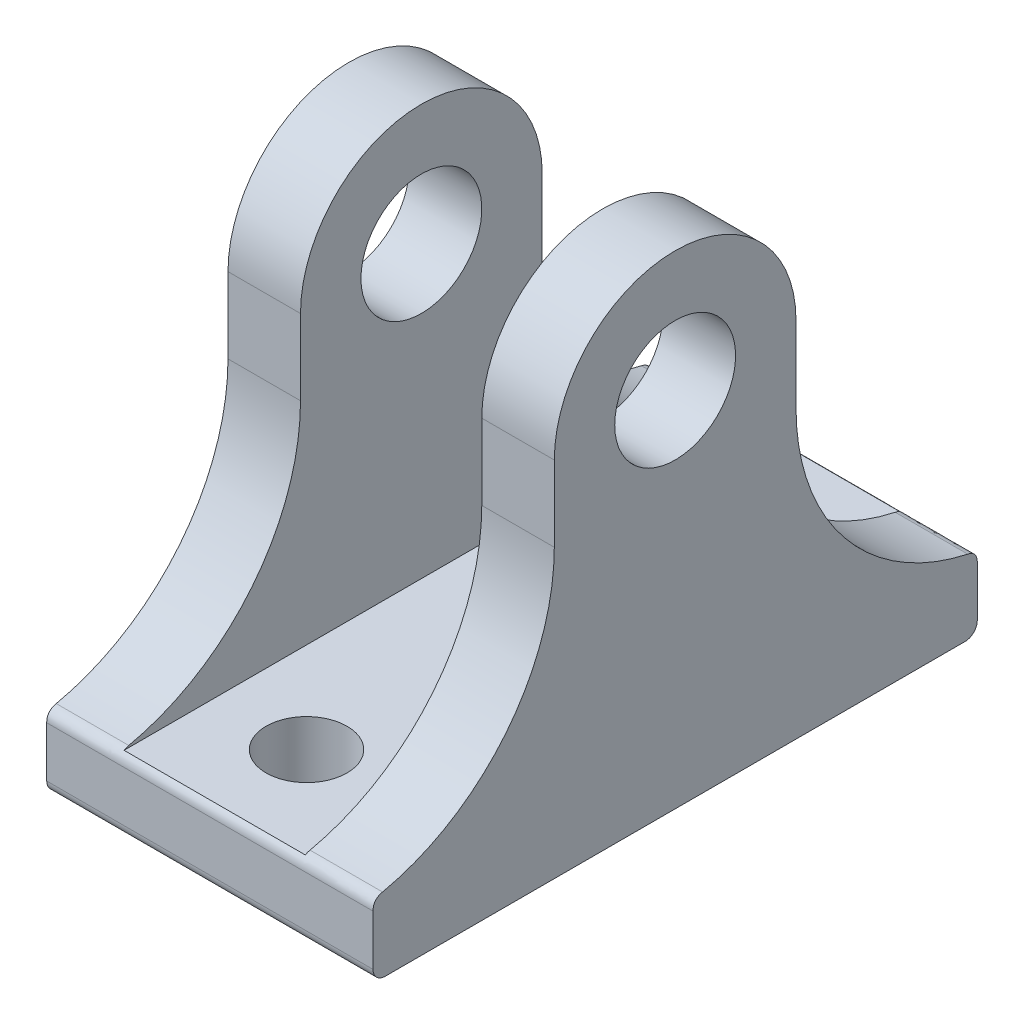
ISO-10303-21;
HEADER;
FILE_DESCRIPTION(('STEP AP214'),'2;1');
FILE_NAME('part.step','',(''),(''),'','','');
FILE_SCHEMA(('AUTOMOTIVE_DESIGN { 1 0 10303 214 1 1 1 1 }'));
ENDSEC;
DATA;
#1=APPLICATION_CONTEXT('core data for automotive mechanical design processes');
#2=APPLICATION_PROTOCOL_DEFINITION('international standard','automotive_design',2000,#1);
#3=PRODUCT_CONTEXT('',#1,'mechanical');
#4=PRODUCT('Part','Part','',(#3));
#5=PRODUCT_RELATED_PRODUCT_CATEGORY('part','',(#4));
#6=PRODUCT_DEFINITION_FORMATION('','',#4);
#7=PRODUCT_DEFINITION_CONTEXT('part definition',#1,'design');
#8=PRODUCT_DEFINITION('design','',#6,#7);
#9=PRODUCT_DEFINITION_SHAPE('','',#8);
#10=(LENGTH_UNIT() NAMED_UNIT(*) SI_UNIT(.MILLI.,.METRE.));
#11=(NAMED_UNIT(*) PLANE_ANGLE_UNIT() SI_UNIT($,.RADIAN.));
#12=(NAMED_UNIT(*) SI_UNIT($,.STERADIAN.) SOLID_ANGLE_UNIT());
#13=UNCERTAINTY_MEASURE_WITH_UNIT(LENGTH_MEASURE(1.E-05),#10,'distance_accuracy_value','');
#14=(GEOMETRIC_REPRESENTATION_CONTEXT(3) GLOBAL_UNCERTAINTY_ASSIGNED_CONTEXT((#13)) GLOBAL_UNIT_ASSIGNED_CONTEXT((#10,
#11,#12)) REPRESENTATION_CONTEXT('',''));
#15=CARTESIAN_POINT('',(0.,0.,0.));
#16=DIRECTION('',(0.,0.,1.));
#17=DIRECTION('',(1.,0.,0.));
#18=AXIS2_PLACEMENT_3D('',#15,#16,#17);
#19=CARTESIAN_POINT('',(13.5,6.,25.));
#20=DIRECTION('',(-1.,0.,0.));
#21=DIRECTION('',(0.,0.,1.));
#22=AXIS2_PLACEMENT_3D('',#19,#20,#21);
#23=PLANE('',#22);
#24=CARTESIAN_POINT('',(13.5,30.,0.));
#25=DIRECTION('',(-1.,0.,0.));
#26=DIRECTION('',(0.,0.,1.));
#27=AXIS2_PLACEMENT_3D('',#24,#25,#26);
#28=CIRCLE('',#27,5.);
#29=CARTESIAN_POINT('',(13.5,30.,5.));
#30=VERTEX_POINT('',#29);
#31=EDGE_CURVE('E523',#30,#30,#28,.T.);
#32=ORIENTED_EDGE('',*,*,#31,.T.);
#33=EDGE_LOOP('',(#32));
#34=FACE_BOUND('',#33,.T.);
#35=DIRECTION('',(0.,-1.,0.));
#36=VECTOR('',#35,1.);
#37=CARTESIAN_POINT('',(13.5,6.,-25.));
#38=LINE('',#37,#36);
#39=CARTESIAN_POINT('',(13.5,5.17406372829214,-25.));
#40=VERTEX_POINT('',#39);
#41=CARTESIAN_POINT('',(13.5,1.,-25.));
#42=VERTEX_POINT('',#41);
#43=EDGE_CURVE('E326',#40,#42,#38,.T.);
#44=ORIENTED_EDGE('',*,*,#43,.F.);
#45=CARTESIAN_POINT('',(13.5,6.15165191887144,-24.2105263157895));
#46=CARTESIAN_POINT('',(13.5,5.98163658137939,-25.));
#47=CARTESIAN_POINT('',(13.5,5.17406372829214,-25.));
#48=(BOUNDED_CURVE() B_SPLINE_CURVE(2,(#45,#46,#47),.UNSPECIFIED.,.F.,
.F.) B_SPLINE_CURVE_WITH_KNOTS((3,3),(0.,1.),
.UNSPECIFIED.) CURVE() GEOMETRIC_REPRESENTATION_ITEM() RATIONAL_B_SPLINE_CURVE((1.,1.,1.)) REPRESENTATION_ITEM(''));
#49=CARTESIAN_POINT('',(13.5,6.15165191887144,-24.2105263157895));
#50=VERTEX_POINT('',#49);
#51=EDGE_CURVE('E524',#40,#50,#48,.F.);
#52=ORIENTED_EDGE('',*,*,#51,.T.);
#53=CARTESIAN_POINT('',(13.5,23.7482393492989,-28.));
#54=DIRECTION('',(-1.,0.,0.));
#55=DIRECTION('',(0.,0.,1.));
#56=AXIS2_PLACEMENT_3D('',#53,#54,#55);
#57=CIRCLE('',#56,18.);
#58=CARTESIAN_POINT('',(13.5,23.7482393492989,-9.99999999999999));
#59=VERTEX_POINT('',#58);
#60=EDGE_CURVE('E425',#50,#59,#57,.T.);
#61=ORIENTED_EDGE('',*,*,#60,.T.);
#62=DIRECTION('',(0.,-1.,0.));
#63=VECTOR('',#62,1.);
#64=CARTESIAN_POINT('',(13.5,30.,-9.99999999999999));
#65=LINE('',#64,#63);
#66=CARTESIAN_POINT('',(13.5,30.,-10.));
#67=VERTEX_POINT('',#66);
#68=EDGE_CURVE('E213',#67,#59,#65,.T.);
#69=ORIENTED_EDGE('',*,*,#68,.F.);
#70=CARTESIAN_POINT('',(13.5,30.,0.));
#71=DIRECTION('',(-1.,0.,0.));
#72=DIRECTION('',(0.,0.,-1.));
#73=AXIS2_PLACEMENT_3D('',#70,#71,#72);
#74=CIRCLE('',#73,10.);
#75=CARTESIAN_POINT('',(13.5,30.,10.));
#76=VERTEX_POINT('',#75);
#77=EDGE_CURVE('E197',#76,#67,#74,.T.);
#78=ORIENTED_EDGE('',*,*,#77,.F.);
#79=DIRECTION('',(0.,-1.,0.));
#80=VECTOR('',#79,1.);
#81=CARTESIAN_POINT('',(13.5,30.,10.));
#82=LINE('',#81,#80);
#83=CARTESIAN_POINT('',(13.5,23.7482393492988,10.));
#84=VERTEX_POINT('',#83);
#85=EDGE_CURVE('E207',#76,#84,#82,.T.);
#86=ORIENTED_EDGE('',*,*,#85,.T.);
#87=CARTESIAN_POINT('',(13.5,23.7482393492988,28.));
#88=DIRECTION('',(-1.,0.,0.));
#89=DIRECTION('',(0.,0.,1.));
#90=AXIS2_PLACEMENT_3D('',#87,#88,#89);
#91=CIRCLE('',#90,18.);
#92=CARTESIAN_POINT('',(13.5,6.15165191887144,24.2105263157895));
#93=VERTEX_POINT('',#92);
#94=EDGE_CURVE('E236',#84,#93,#91,.T.);
#95=ORIENTED_EDGE('',*,*,#94,.T.);
#96=CARTESIAN_POINT('',(13.5,5.17406372829214,25.));
#97=CARTESIAN_POINT('',(13.5,5.98163658137939,25.));
#98=CARTESIAN_POINT('',(13.5,6.15165191887144,24.2105263157895));
#99=CARTESIAN_POINT('',(13.5,6.15335207224636,24.2026315789474));
#100=CARTESIAN_POINT('',(13.5,6.15505222562128,24.1947368421053));
#101=(BOUNDED_CURVE() B_SPLINE_CURVE(2,(#96,#97,#98,#99,#100),.UNSPECIFIED.,.F.,
.F.) B_SPLINE_CURVE_WITH_KNOTS((3,2,3),(-0.01,0.99,1.),
.UNSPECIFIED.) CURVE() GEOMETRIC_REPRESENTATION_ITEM() RATIONAL_B_SPLINE_CURVE((1.,1.,1.,1.,1.)) REPRESENTATION_ITEM(''));
#102=CARTESIAN_POINT('',(13.5,5.17406372829214,25.));
#103=VERTEX_POINT('',#102);
#104=EDGE_CURVE('E596',#93,#103,#101,.F.);
#105=ORIENTED_EDGE('',*,*,#104,.T.);
#106=DIRECTION('',(0.,-1.,0.));
#107=VECTOR('',#106,1.);
#108=CARTESIAN_POINT('',(13.5,6.,25.));
#109=LINE('',#108,#107);
#110=CARTESIAN_POINT('',(13.5,1.,25.));
#111=VERTEX_POINT('',#110);
#112=EDGE_CURVE('E255',#103,#111,#109,.T.);
#113=ORIENTED_EDGE('',*,*,#112,.T.);
#114=CARTESIAN_POINT('',(13.5,1.,24.));
#115=DIRECTION('',(-1.,0.,0.));
#116=DIRECTION('',(0.,0.,1.));
#117=AXIS2_PLACEMENT_3D('',#114,#115,#116);
#118=CIRCLE('',#117,1.);
#119=CARTESIAN_POINT('',(13.5,0.,24.));
#120=VERTEX_POINT('',#119);
#121=EDGE_CURVE('E450',#111,#120,#118,.F.);
#122=ORIENTED_EDGE('',*,*,#121,.T.);
#123=DIRECTION('',(0.,0.,-1.));
#124=VECTOR('',#123,1.);
#125=CARTESIAN_POINT('',(13.5,0.,25.));
#126=LINE('',#125,#124);
#127=CARTESIAN_POINT('',(13.5,0.,-24.));
#128=VERTEX_POINT('',#127);
#129=EDGE_CURVE('E479',#120,#128,#126,.T.);
#130=ORIENTED_EDGE('',*,*,#129,.T.);
#131=CARTESIAN_POINT('',(13.5,1.,-24.));
#132=DIRECTION('',(-1.,0.,0.));
#133=DIRECTION('',(0.,0.,1.));
#134=AXIS2_PLACEMENT_3D('',#131,#132,#133);
#135=CIRCLE('',#134,1.);
#136=EDGE_CURVE('E447',#128,#42,#135,.F.);
#137=ORIENTED_EDGE('',*,*,#136,.T.);
#138=EDGE_LOOP('',(#44,#52,#61,#69,#78,#86,#95,#105,#113,#122,#130,#137));
#139=FACE_BOUND('',#138,.T.);
#140=ADVANCED_FACE('F40',(#34,#139),#23,.F.);
#141=CARTESIAN_POINT('',(-13.5,6.,-25.));
#142=DIRECTION('',(0.,0.,1.));
#143=DIRECTION('',(1.,0.,0.));
#144=AXIS2_PLACEMENT_3D('',#141,#142,#143);
#145=PLANE('',#144);
#146=DIRECTION('',(0.,-1.,0.));
#147=VECTOR('',#146,1.);
#148=CARTESIAN_POINT('',(-13.5,6.,-25.));
#149=LINE('',#148,#147);
#150=CARTESIAN_POINT('',(-13.5,5.17406372829214,-25.));
#151=VERTEX_POINT('',#150);
#152=CARTESIAN_POINT('',(-13.5,1.,-25.));
#153=VERTEX_POINT('',#152);
#154=EDGE_CURVE('E272',#151,#153,#149,.T.);
#155=ORIENTED_EDGE('',*,*,#154,.F.);
#156=CARTESIAN_POINT('',(14.85,5.17406372829214,-25.));
#157=CARTESIAN_POINT('',(4.95,5.17406372829214,-25.));
#158=CARTESIAN_POINT('',(-4.95,5.17406372829214,-25.));
#159=CARTESIAN_POINT('',(-14.85,5.17406372829214,-25.));
#160=(BOUNDED_CURVE() B_SPLINE_CURVE(3,(#156,#157,#158,#159),.UNSPECIFIED.,.F.,
.F.) B_SPLINE_CURVE_WITH_KNOTS((4,4),(-0.01485,0.01485),
.UNSPECIFIED.) CURVE() GEOMETRIC_REPRESENTATION_ITEM() RATIONAL_B_SPLINE_CURVE((1.,1.,1.,1.)) REPRESENTATION_ITEM(''));
#161=EDGE_CURVE('E528',#151,#40,#160,.F.);
#162=ORIENTED_EDGE('',*,*,#161,.T.);
#163=ORIENTED_EDGE('',*,*,#43,.T.);
#164=DIRECTION('',(-1.,0.,0.));
#165=VECTOR('',#164,1.);
#166=CARTESIAN_POINT('',(-13.5,1.,-25.));
#167=LINE('',#166,#165);
#168=EDGE_CURVE('E246',#42,#153,#167,.T.);
#169=ORIENTED_EDGE('',*,*,#168,.T.);
#170=EDGE_LOOP('',(#155,#162,#163,#169));
#171=FACE_BOUND('',#170,.T.);
#172=ADVANCED_FACE('F407',(#171),#145,.F.);
#173=CARTESIAN_POINT('',(-13.5,6.,25.));
#174=DIRECTION('',(1.,0.,0.));
#175=DIRECTION('',(0.,0.,-1.));
#176=AXIS2_PLACEMENT_3D('',#173,#174,#175);
#177=PLANE('',#176);
#178=CARTESIAN_POINT('',(-13.5,23.7482393492988,-28.));
#179=DIRECTION('',(1.,0.,0.));
#180=DIRECTION('',(0.,0.,-1.));
#181=AXIS2_PLACEMENT_3D('',#178,#179,#180);
#182=CIRCLE('',#181,18.);
#183=CARTESIAN_POINT('',(-13.5,23.7482393492988,-9.99999999999999));
#184=VERTEX_POINT('',#183);
#185=CARTESIAN_POINT('',(-13.5,6.15165191887144,-24.2105263157895));
#186=VERTEX_POINT('',#185);
#187=EDGE_CURVE('E278',#184,#186,#182,.T.);
#188=ORIENTED_EDGE('',*,*,#187,.T.);
#189=CARTESIAN_POINT('',(-13.5,5.17406372829214,-25.));
#190=CARTESIAN_POINT('',(-13.5,5.98163658137939,-25.));
#191=CARTESIAN_POINT('',(-13.5,6.15165191887144,-24.2105263157895));
#192=(BOUNDED_CURVE() B_SPLINE_CURVE(2,(#189,#190,#191),.UNSPECIFIED.,.F.,
.F.) B_SPLINE_CURVE_WITH_KNOTS((3,3),(0.,1.),
.UNSPECIFIED.) CURVE() GEOMETRIC_REPRESENTATION_ITEM() RATIONAL_B_SPLINE_CURVE((1.,1.,1.)) REPRESENTATION_ITEM(''));
#193=EDGE_CURVE('E594',#186,#151,#192,.F.);
#194=ORIENTED_EDGE('',*,*,#193,.T.);
#195=ORIENTED_EDGE('',*,*,#154,.T.);
#196=CARTESIAN_POINT('',(-13.5,1.,-24.));
#197=DIRECTION('',(1.,0.,0.));
#198=DIRECTION('',(0.,0.,-1.));
#199=AXIS2_PLACEMENT_3D('',#196,#197,#198);
#200=CIRCLE('',#199,1.);
#201=CARTESIAN_POINT('',(-13.5,0.,-24.));
#202=VERTEX_POINT('',#201);
#203=EDGE_CURVE('E458',#153,#202,#200,.F.);
#204=ORIENTED_EDGE('',*,*,#203,.T.);
#205=DIRECTION('',(0.,0.,1.));
#206=VECTOR('',#205,1.);
#207=CARTESIAN_POINT('',(-13.5,0.,25.));
#208=LINE('',#207,#206);
#209=CARTESIAN_POINT('',(-13.5,0.,24.));
#210=VERTEX_POINT('',#209);
#211=EDGE_CURVE('E259',#202,#210,#208,.T.);
#212=ORIENTED_EDGE('',*,*,#211,.T.);
#213=CARTESIAN_POINT('',(-13.5,1.,24.));
#214=DIRECTION('',(1.,0.,0.));
#215=DIRECTION('',(0.,0.,-1.));
#216=AXIS2_PLACEMENT_3D('',#213,#214,#215);
#217=CIRCLE('',#216,1.);
#218=CARTESIAN_POINT('',(-13.5,1.,25.));
#219=VERTEX_POINT('',#218);
#220=EDGE_CURVE('E459',#210,#219,#217,.F.);
#221=ORIENTED_EDGE('',*,*,#220,.T.);
#222=DIRECTION('',(0.,-1.,0.));
#223=VECTOR('',#222,1.);
#224=CARTESIAN_POINT('',(-13.5,6.,25.));
#225=LINE('',#224,#223);
#226=CARTESIAN_POINT('',(-13.5,5.17406372829214,25.));
#227=VERTEX_POINT('',#226);
#228=EDGE_CURVE('E258',#227,#219,#225,.T.);
#229=ORIENTED_EDGE('',*,*,#228,.F.);
#230=CARTESIAN_POINT('',(-13.5,6.15505222562128,24.1947368421053));
#231=CARTESIAN_POINT('',(-13.5,6.15335207224636,24.2026315789474));
#232=CARTESIAN_POINT('',(-13.5,6.15165191887144,24.2105263157895));
#233=CARTESIAN_POINT('',(-13.5,5.98163658137939,25.));
#234=CARTESIAN_POINT('',(-13.5,5.17406372829214,25.));
#235=(BOUNDED_CURVE() B_SPLINE_CURVE(2,(#230,#231,#232,#233,#234),.UNSPECIFIED.,.F.,
.F.) B_SPLINE_CURVE_WITH_KNOTS((3,2,3),(-0.01,0.,1.),
.UNSPECIFIED.) CURVE() GEOMETRIC_REPRESENTATION_ITEM() RATIONAL_B_SPLINE_CURVE((1.,1.,1.,1.,1.)) REPRESENTATION_ITEM(''));
#236=CARTESIAN_POINT('',(-13.5,6.15165191887144,24.2105263157895));
#237=VERTEX_POINT('',#236);
#238=EDGE_CURVE('E442',#227,#237,#235,.F.);
#239=ORIENTED_EDGE('',*,*,#238,.T.);
#240=CARTESIAN_POINT('',(-13.5,23.7482393492989,28.));
#241=DIRECTION('',(1.,0.,0.));
#242=DIRECTION('',(0.,0.,-1.));
#243=AXIS2_PLACEMENT_3D('',#240,#241,#242);
#244=CIRCLE('',#243,18.);
#245=CARTESIAN_POINT('',(-13.5,23.7482393492989,10.));
#246=VERTEX_POINT('',#245);
#247=EDGE_CURVE('E274',#237,#246,#244,.T.);
#248=ORIENTED_EDGE('',*,*,#247,.T.);
#249=DIRECTION('',(0.,-1.,0.));
#250=VECTOR('',#249,1.);
#251=CARTESIAN_POINT('',(-13.5,30.,10.));
#252=LINE('',#251,#250);
#253=CARTESIAN_POINT('',(-13.5,30.,10.));
#254=VERTEX_POINT('',#253);
#255=EDGE_CURVE('E482',#254,#246,#252,.T.);
#256=ORIENTED_EDGE('',*,*,#255,.F.);
#257=CARTESIAN_POINT('',(-13.5,30.,0.));
#258=DIRECTION('',(-1.,0.,0.));
#259=DIRECTION('',(0.,0.,-1.));
#260=AXIS2_PLACEMENT_3D('',#257,#258,#259);
#261=CIRCLE('',#260,10.);
#262=CARTESIAN_POINT('',(-13.5,30.,-9.99999999999999));
#263=VERTEX_POINT('',#262);
#264=EDGE_CURVE('E681',#254,#263,#261,.T.);
#265=ORIENTED_EDGE('',*,*,#264,.T.);
#266=DIRECTION('',(0.,-1.,0.));
#267=VECTOR('',#266,1.);
#268=CARTESIAN_POINT('',(-13.5,30.,-9.99999999999999));
#269=LINE('',#268,#267);
#270=EDGE_CURVE('E487',#263,#184,#269,.T.);
#271=ORIENTED_EDGE('',*,*,#270,.T.);
#272=EDGE_LOOP('',(#188,#194,#195,#204,#212,#221,#229,#239,#248,#256,#265,#271));
#273=FACE_BOUND('',#272,.T.);
#274=CARTESIAN_POINT('',(-13.5,30.,0.));
#275=DIRECTION('',(-1.,0.,0.));
#276=DIRECTION('',(0.,0.,1.));
#277=AXIS2_PLACEMENT_3D('',#274,#275,#276);
#278=CIRCLE('',#277,5.);
#279=CARTESIAN_POINT('',(-13.5,30.,5.));
#280=VERTEX_POINT('',#279);
#281=EDGE_CURVE('E196',#280,#280,#278,.T.);
#282=ORIENTED_EDGE('',*,*,#281,.F.);
#283=EDGE_LOOP('',(#282));
#284=FACE_BOUND('',#283,.T.);
#285=ADVANCED_FACE('F403',(#273,#284),#177,.F.);
#286=CARTESIAN_POINT('',(-13.5,6.,25.));
#287=DIRECTION('',(0.,0.,-1.));
#288=DIRECTION('',(-1.,0.,0.));
#289=AXIS2_PLACEMENT_3D('',#286,#287,#288);
#290=PLANE('',#289);
#291=ORIENTED_EDGE('',*,*,#112,.F.);
#292=CARTESIAN_POINT('',(-14.85,5.17406372829214,25.));
#293=CARTESIAN_POINT('',(-4.95,5.17406372829214,25.));
#294=CARTESIAN_POINT('',(4.94999999999999,5.17406372829214,25.));
#295=CARTESIAN_POINT('',(14.85,5.17406372829214,25.));
#296=(BOUNDED_CURVE() B_SPLINE_CURVE(3,(#292,#293,#294,#295),.UNSPECIFIED.,.F.,
.F.) B_SPLINE_CURVE_WITH_KNOTS((4,4),(-0.01485,0.01485),
.UNSPECIFIED.) CURVE() GEOMETRIC_REPRESENTATION_ITEM() RATIONAL_B_SPLINE_CURVE((1.,1.,1.,1.)) REPRESENTATION_ITEM(''));
#297=EDGE_CURVE('E12',#103,#227,#296,.F.);
#298=ORIENTED_EDGE('',*,*,#297,.T.);
#299=ORIENTED_EDGE('',*,*,#228,.T.);
#300=DIRECTION('',(1.,0.,0.));
#301=VECTOR('',#300,1.);
#302=CARTESIAN_POINT('',(13.5,1.,25.));
#303=LINE('',#302,#301);
#304=EDGE_CURVE('E445',#219,#111,#303,.T.);
#305=ORIENTED_EDGE('',*,*,#304,.T.);
#306=EDGE_LOOP('',(#291,#298,#299,#305));
#307=FACE_BOUND('',#306,.T.);
#308=ADVANCED_FACE('F392',(#307),#290,.F.);
#309=CARTESIAN_POINT('',(0.,6.,0.));
#310=DIRECTION('',(0.,-1.,0.));
#311=DIRECTION('',(0.,0.,-1.));
#312=AXIS2_PLACEMENT_3D('',#309,#310,#311);
#313=PLANE('',#312);
#314=CARTESIAN_POINT('',(0.,6.,-17.));
#315=DIRECTION('',(0.,1.,0.));
#316=DIRECTION('',(0.,0.,1.));
#317=AXIS2_PLACEMENT_3D('',#314,#315,#316);
#318=CIRCLE('',#317,3.350000031);
#319=CARTESIAN_POINT('',(0.,6.,-13.649999969));
#320=VERTEX_POINT('',#319);
#321=EDGE_CURVE('E598',#320,#320,#318,.T.);
#322=ORIENTED_EDGE('',*,*,#321,.F.);
#323=EDGE_LOOP('',(#322));
#324=FACE_BOUND('',#323,.T.);
#325=CARTESIAN_POINT('',(0.,6.,17.));
#326=DIRECTION('',(0.,-1.,0.));
#327=DIRECTION('',(0.,0.,-1.));
#328=AXIS2_PLACEMENT_3D('',#325,#326,#327);
#329=CIRCLE('',#328,3.350000031);
#330=CARTESIAN_POINT('',(0.,6.,13.649999969));
#331=VERTEX_POINT('',#330);
#332=EDGE_CURVE('E693',#331,#331,#329,.T.);
#333=ORIENTED_EDGE('',*,*,#332,.T.);
#334=EDGE_LOOP('',(#333));
#335=FACE_BOUND('',#334,.T.);
#336=DIRECTION('',(0.,0.,-1.));
#337=VECTOR('',#336,1.);
#338=CARTESIAN_POINT('',(7.5,6.,0.));
#339=LINE('',#338,#337);
#340=CARTESIAN_POINT('',(7.5,6.,24.6011161096643));
#341=VERTEX_POINT('',#340);
#342=CARTESIAN_POINT('',(7.50000000000001,6.,-24.6011161096658));
#343=VERTEX_POINT('',#342);
#344=EDGE_CURVE('E206',#341,#343,#339,.T.);
#345=ORIENTED_EDGE('',*,*,#344,.T.);
#346=CARTESIAN_POINT('',(-14.85,6.,-24.6011161096658));
#347=CARTESIAN_POINT('',(-4.95,6.,-24.6011161096658));
#348=CARTESIAN_POINT('',(4.95,6.,-24.6011161096658));
#349=CARTESIAN_POINT('',(14.85,6.,-24.6011161096658));
#350=(BOUNDED_CURVE() B_SPLINE_CURVE(3,(#346,#347,#348,#349),.UNSPECIFIED.,.F.,
.F.) B_SPLINE_CURVE_WITH_KNOTS((4,4),(-0.01485,0.01485),
.UNSPECIFIED.) CURVE() GEOMETRIC_REPRESENTATION_ITEM() RATIONAL_B_SPLINE_CURVE((1.,1.,1.,1.)) REPRESENTATION_ITEM(''));
#351=CARTESIAN_POINT('',(-7.5,6.,-24.6011161096643));
#352=VERTEX_POINT('',#351);
#353=EDGE_CURVE('E589',#343,#352,#350,.F.);
#354=ORIENTED_EDGE('',*,*,#353,.T.);
#355=DIRECTION('',(0.,0.,1.));
#356=VECTOR('',#355,1.);
#357=CARTESIAN_POINT('',(-7.5,6.,0.));
#358=LINE('',#357,#356);
#359=CARTESIAN_POINT('',(-7.50000000000001,6.,24.6011161096658));
#360=VERTEX_POINT('',#359);
#361=EDGE_CURVE('E480',#352,#360,#358,.T.);
#362=ORIENTED_EDGE('',*,*,#361,.T.);
#363=CARTESIAN_POINT('',(14.85,6.,24.6011161096658));
#364=CARTESIAN_POINT('',(4.94999999999999,6.,24.6011161096658));
#365=CARTESIAN_POINT('',(-4.95,6.,24.6011161096658));
#366=CARTESIAN_POINT('',(-14.85,6.,24.6011161096658));
#367=(BOUNDED_CURVE() B_SPLINE_CURVE(3,(#363,#364,#365,#366),.UNSPECIFIED.,.F.,
.F.) B_SPLINE_CURVE_WITH_KNOTS((4,4),(-0.01485,0.01485),
.UNSPECIFIED.) CURVE() GEOMETRIC_REPRESENTATION_ITEM() RATIONAL_B_SPLINE_CURVE((1.,1.,1.,1.)) REPRESENTATION_ITEM(''));
#368=EDGE_CURVE('E497',#360,#341,#367,.F.);
#369=ORIENTED_EDGE('',*,*,#368,.T.);
#370=EDGE_LOOP('',(#345,#354,#362,#369));
#371=FACE_BOUND('',#370,.T.);
#372=ADVANCED_FACE('F402',(#324,#335,#371),#313,.F.);
#373=CARTESIAN_POINT('',(0.,0.,0.));
#374=DIRECTION('',(0.,-1.,0.));
#375=DIRECTION('',(0.,0.,-1.));
#376=AXIS2_PLACEMENT_3D('',#373,#374,#375);
#377=PLANE('',#376);
#378=CARTESIAN_POINT('',(0.,0.,-17.));
#379=DIRECTION('',(0.,1.,0.));
#380=DIRECTION('',(0.,0.,1.));
#381=AXIS2_PLACEMENT_3D('',#378,#379,#380);
#382=CIRCLE('',#381,3.350000031);
#383=CARTESIAN_POINT('',(0.,0.,-13.649999969));
#384=VERTEX_POINT('',#383);
#385=EDGE_CURVE('E595',#384,#384,#382,.T.);
#386=ORIENTED_EDGE('',*,*,#385,.T.);
#387=EDGE_LOOP('',(#386));
#388=FACE_BOUND('',#387,.T.);
#389=CARTESIAN_POINT('',(0.,0.,17.));
#390=DIRECTION('',(0.,-1.,0.));
#391=DIRECTION('',(0.,0.,-1.));
#392=AXIS2_PLACEMENT_3D('',#389,#390,#391);
#393=CIRCLE('',#392,3.350000031);
#394=CARTESIAN_POINT('',(0.,0.,13.649999969));
#395=VERTEX_POINT('',#394);
#396=EDGE_CURVE('E696',#395,#395,#393,.T.);
#397=ORIENTED_EDGE('',*,*,#396,.F.);
#398=EDGE_LOOP('',(#397));
#399=FACE_BOUND('',#398,.T.);
#400=ORIENTED_EDGE('',*,*,#211,.F.);
#401=DIRECTION('',(-1.,0.,0.));
#402=VECTOR('',#401,1.);
#403=CARTESIAN_POINT('',(13.5,0.,-24.));
#404=LINE('',#403,#402);
#405=EDGE_CURVE('E454',#202,#128,#404,.F.);
#406=ORIENTED_EDGE('',*,*,#405,.T.);
#407=ORIENTED_EDGE('',*,*,#129,.F.);
#408=DIRECTION('',(1.,0.,0.));
#409=VECTOR('',#408,1.);
#410=CARTESIAN_POINT('',(-13.5,0.,24.));
#411=LINE('',#410,#409);
#412=EDGE_CURVE('E456',#120,#210,#411,.F.);
#413=ORIENTED_EDGE('',*,*,#412,.T.);
#414=EDGE_LOOP('',(#400,#406,#407,#413));
#415=FACE_BOUND('',#414,.T.);
#416=ADVANCED_FACE('F404',(#388,#399,#415),#377,.T.);
#417=CARTESIAN_POINT('',(-13.5,30.,10.));
#418=DIRECTION('',(0.,0.,1.));
#419=DIRECTION('',(1.,0.,0.));
#420=AXIS2_PLACEMENT_3D('',#417,#418,#419);
#421=PLANE('',#420);
#422=ORIENTED_EDGE('',*,*,#255,.T.);
#423=DIRECTION('',(-1.,0.,0.));
#424=VECTOR('',#423,1.);
#425=CARTESIAN_POINT('',(-7.50000000000002,23.7482393492989,10.));
#426=LINE('',#425,#424);
#427=CARTESIAN_POINT('',(-7.50000000000001,23.7482393492989,10.));
#428=VERTEX_POINT('',#427);
#429=EDGE_CURVE('E336',#246,#428,#426,.F.);
#430=ORIENTED_EDGE('',*,*,#429,.T.);
#431=DIRECTION('',(0.,-1.,0.));
#432=VECTOR('',#431,1.);
#433=CARTESIAN_POINT('',(-7.50000000000001,30.,10.));
#434=LINE('',#433,#432);
#435=CARTESIAN_POINT('',(-7.5,30.,10.));
#436=VERTEX_POINT('',#435);
#437=EDGE_CURVE('E666',#436,#428,#434,.T.);
#438=ORIENTED_EDGE('',*,*,#437,.F.);
#439=DIRECTION('',(-1.,0.,0.));
#440=VECTOR('',#439,1.);
#441=CARTESIAN_POINT('',(-13.5,30.,10.));
#442=LINE('',#441,#440);
#443=EDGE_CURVE('E673',#436,#254,#442,.T.);
#444=ORIENTED_EDGE('',*,*,#443,.T.);
#445=EDGE_LOOP('',(#422,#430,#438,#444));
#446=FACE_BOUND('',#445,.T.);
#447=ADVANCED_FACE('F319',(#446),#421,.T.);
#448=CARTESIAN_POINT('',(-7.50000000000001,30.,10.));
#449=DIRECTION('',(1.,0.,0.));
#450=DIRECTION('',(0.,0.,-1.));
#451=AXIS2_PLACEMENT_3D('',#448,#449,#450);
#452=PLANE('',#451);
#453=CARTESIAN_POINT('',(-7.5,30.,0.));
#454=DIRECTION('',(-1.,0.,0.));
#455=DIRECTION('',(0.,0.,1.));
#456=AXIS2_PLACEMENT_3D('',#453,#454,#455);
#457=CIRCLE('',#456,5.);
#458=CARTESIAN_POINT('',(-7.5,30.,5.));
#459=VERTEX_POINT('',#458);
#460=EDGE_CURVE('E684',#459,#459,#457,.T.);
#461=ORIENTED_EDGE('',*,*,#460,.T.);
#462=EDGE_LOOP('',(#461));
#463=FACE_BOUND('',#462,.T.);
#464=ORIENTED_EDGE('',*,*,#361,.F.);
#465=CARTESIAN_POINT('',(-7.5,6.15165191887144,-24.2105263157895));
#466=CARTESIAN_POINT('',(-7.5,5.98163658137939,-25.));
#467=CARTESIAN_POINT('',(-7.5,5.17406372829214,-25.));
#468=(BOUNDED_CURVE() B_SPLINE_CURVE(2,(#465,#466,#467),.UNSPECIFIED.,.F.,
.F.) B_SPLINE_CURVE_WITH_KNOTS((3,3),(0.,1.),
.UNSPECIFIED.) CURVE() GEOMETRIC_REPRESENTATION_ITEM() RATIONAL_B_SPLINE_CURVE((1.,1.,1.)) REPRESENTATION_ITEM(''));
#469=CARTESIAN_POINT('',(-7.5,6.15165191887144,-24.2105263157895));
#470=VERTEX_POINT('',#469);
#471=EDGE_CURVE('E590',#352,#470,#468,.F.);
#472=ORIENTED_EDGE('',*,*,#471,.T.);
#473=CARTESIAN_POINT('',(-7.5,23.7482393492988,-28.));
#474=DIRECTION('',(1.,0.,0.));
#475=DIRECTION('',(0.,0.,-1.));
#476=AXIS2_PLACEMENT_3D('',#473,#474,#475);
#477=CIRCLE('',#476,18.);
#478=CARTESIAN_POINT('',(-7.5,23.7482393492988,-9.99999999999999));
#479=VERTEX_POINT('',#478);
#480=EDGE_CURVE('E337',#470,#479,#477,.F.);
#481=ORIENTED_EDGE('',*,*,#480,.T.);
#482=DIRECTION('',(0.,-1.,0.));
#483=VECTOR('',#482,1.);
#484=CARTESIAN_POINT('',(-7.5,30.,-9.99999999999999));
#485=LINE('',#484,#483);
#486=CARTESIAN_POINT('',(-7.5,30.,-10.));
#487=VERTEX_POINT('',#486);
#488=EDGE_CURVE('E669',#487,#479,#485,.T.);
#489=ORIENTED_EDGE('',*,*,#488,.F.);
#490=CARTESIAN_POINT('',(-7.5,30.,0.));
#491=DIRECTION('',(-1.,0.,0.));
#492=DIRECTION('',(0.,0.,-1.));
#493=AXIS2_PLACEMENT_3D('',#490,#491,#492);
#494=CIRCLE('',#493,10.);
#495=EDGE_CURVE('E215',#436,#487,#494,.T.);
#496=ORIENTED_EDGE('',*,*,#495,.F.);
#497=ORIENTED_EDGE('',*,*,#437,.T.);
#498=CARTESIAN_POINT('',(-7.50000000000001,23.7482393492989,28.));
#499=DIRECTION('',(1.,0.,0.));
#500=DIRECTION('',(0.,0.,-1.));
#501=AXIS2_PLACEMENT_3D('',#498,#499,#500);
#502=CIRCLE('',#501,18.);
#503=CARTESIAN_POINT('',(-7.50000000000001,6.15165191887144,24.2105263157895));
#504=VERTEX_POINT('',#503);
#505=EDGE_CURVE('E277',#428,#504,#502,.F.);
#506=ORIENTED_EDGE('',*,*,#505,.T.);
#507=CARTESIAN_POINT('',(-7.50000000000001,5.17406372829214,25.));
#508=CARTESIAN_POINT('',(-7.50000000000001,5.98163658137939,25.));
#509=CARTESIAN_POINT('',(-7.50000000000001,6.15165191887144,24.2105263157895));
#510=CARTESIAN_POINT('',(-7.50000000000001,6.15335207224636,24.2026315789474));
#511=CARTESIAN_POINT('',(-7.50000000000001,6.15505222562128,24.1947368421053));
#512=(BOUNDED_CURVE() B_SPLINE_CURVE(2,(#507,#508,#509,#510,#511),.UNSPECIFIED.,.F.,
.F.) B_SPLINE_CURVE_WITH_KNOTS((3,2,3),(-0.01,0.99,1.),
.UNSPECIFIED.) CURVE() GEOMETRIC_REPRESENTATION_ITEM() RATIONAL_B_SPLINE_CURVE((1.,1.,1.,1.,1.)) REPRESENTATION_ITEM(''));
#513=EDGE_CURVE('E301',#504,#360,#512,.F.);
#514=ORIENTED_EDGE('',*,*,#513,.T.);
#515=EDGE_LOOP('',(#464,#472,#481,#489,#496,#497,#506,#514));
#516=FACE_BOUND('',#515,.T.);
#517=ADVANCED_FACE('F308',(#463,#516),#452,.T.);
#518=CARTESIAN_POINT('',(-7.5,30.,-9.99999999999999));
#519=DIRECTION('',(0.,0.,-1.));
#520=DIRECTION('',(-1.,0.,0.));
#521=AXIS2_PLACEMENT_3D('',#518,#519,#520);
#522=PLANE('',#521);
#523=ORIENTED_EDGE('',*,*,#488,.T.);
#524=DIRECTION('',(1.,0.,0.));
#525=VECTOR('',#524,1.);
#526=CARTESIAN_POINT('',(-13.5,23.7482393492988,-9.99999999999999));
#527=LINE('',#526,#525);
#528=EDGE_CURVE('E332',#479,#184,#527,.F.);
#529=ORIENTED_EDGE('',*,*,#528,.T.);
#530=ORIENTED_EDGE('',*,*,#270,.F.);
#531=DIRECTION('',(1.,0.,0.));
#532=VECTOR('',#531,1.);
#533=CARTESIAN_POINT('',(-7.5,30.,-9.99999999999999));
#534=LINE('',#533,#532);
#535=EDGE_CURVE('E224',#263,#487,#534,.T.);
#536=ORIENTED_EDGE('',*,*,#535,.T.);
#537=EDGE_LOOP('',(#523,#529,#530,#536));
#538=FACE_BOUND('',#537,.T.);
#539=ADVANCED_FACE('F318',(#538),#522,.T.);
#540=CARTESIAN_POINT('',(7.5,30.,10.));
#541=DIRECTION('',(-1.,0.,0.));
#542=DIRECTION('',(0.,0.,1.));
#543=AXIS2_PLACEMENT_3D('',#540,#541,#542);
#544=PLANE('',#543);
#545=CARTESIAN_POINT('',(7.5,30.,0.));
#546=DIRECTION('',(-1.,0.,0.));
#547=DIRECTION('',(0.,0.,1.));
#548=AXIS2_PLACEMENT_3D('',#545,#546,#547);
#549=CIRCLE('',#548,5.);
#550=CARTESIAN_POINT('',(7.5,30.,5.));
#551=VERTEX_POINT('',#550);
#552=EDGE_CURVE('E690',#551,#551,#549,.T.);
#553=ORIENTED_EDGE('',*,*,#552,.F.);
#554=EDGE_LOOP('',(#553));
#555=FACE_BOUND('',#554,.T.);
#556=CARTESIAN_POINT('',(7.50000000000001,23.7482393492989,-28.));
#557=DIRECTION('',(-1.,0.,0.));
#558=DIRECTION('',(0.,0.,1.));
#559=AXIS2_PLACEMENT_3D('',#556,#557,#558);
#560=CIRCLE('',#559,18.);
#561=CARTESIAN_POINT('',(7.50000000000001,23.7482393492989,-9.99999999999999));
#562=VERTEX_POINT('',#561);
#563=CARTESIAN_POINT('',(7.50000000000001,6.15165191887144,-24.2105263157895));
#564=VERTEX_POINT('',#563);
#565=EDGE_CURVE('E237',#562,#564,#560,.F.);
#566=ORIENTED_EDGE('',*,*,#565,.T.);
#567=CARTESIAN_POINT('',(7.50000000000001,5.17406372829214,-25.));
#568=CARTESIAN_POINT('',(7.50000000000001,5.98163658137939,-25.));
#569=CARTESIAN_POINT('',(7.50000000000001,6.15165191887144,-24.2105263157895));
#570=(BOUNDED_CURVE() B_SPLINE_CURVE(2,(#567,#568,#569),.UNSPECIFIED.,.F.,
.F.) B_SPLINE_CURVE_WITH_KNOTS((3,3),(0.,1.),
.UNSPECIFIED.) CURVE() GEOMETRIC_REPRESENTATION_ITEM() RATIONAL_B_SPLINE_CURVE((1.,1.,1.)) REPRESENTATION_ITEM(''));
#571=EDGE_CURVE('E443',#564,#343,#570,.F.);
#572=ORIENTED_EDGE('',*,*,#571,.T.);
#573=ORIENTED_EDGE('',*,*,#344,.F.);
#574=CARTESIAN_POINT('',(7.49999999999999,6.15505222562128,24.1947368421053));
#575=CARTESIAN_POINT('',(7.49999999999999,6.15335207224636,24.2026315789474));
#576=CARTESIAN_POINT('',(7.49999999999999,6.15165191887144,24.2105263157895));
#577=CARTESIAN_POINT('',(7.49999999999999,5.98163658137939,25.));
#578=CARTESIAN_POINT('',(7.49999999999999,5.17406372829214,25.));
#579=(BOUNDED_CURVE() B_SPLINE_CURVE(2,(#574,#575,#576,#577,#578),.UNSPECIFIED.,.F.,
.F.) B_SPLINE_CURVE_WITH_KNOTS((3,2,3),(-0.01,0.,1.),
.UNSPECIFIED.) CURVE() GEOMETRIC_REPRESENTATION_ITEM() RATIONAL_B_SPLINE_CURVE((1.,1.,1.,1.,1.)) REPRESENTATION_ITEM(''));
#580=CARTESIAN_POINT('',(7.5,6.15165216303868,24.2105251819883));
#581=VERTEX_POINT('',#580);
#582=EDGE_CURVE('E441',#341,#581,#579,.F.);
#583=ORIENTED_EDGE('',*,*,#582,.T.);
#584=CARTESIAN_POINT('',(7.5,23.7482393492988,28.));
#585=DIRECTION('',(-1.,0.,0.));
#586=DIRECTION('',(0.,0.,1.));
#587=AXIS2_PLACEMENT_3D('',#584,#585,#586);
#588=CIRCLE('',#587,18.);
#589=CARTESIAN_POINT('',(7.5,23.7482393492988,10.));
#590=VERTEX_POINT('',#589);
#591=EDGE_CURVE('E203',#581,#590,#588,.F.);
#592=ORIENTED_EDGE('',*,*,#591,.T.);
#593=DIRECTION('',(0.,-1.,0.));
#594=VECTOR('',#593,1.);
#595=CARTESIAN_POINT('',(7.5,30.,10.));
#596=LINE('',#595,#594);
#597=CARTESIAN_POINT('',(7.5,30.,10.));
#598=VERTEX_POINT('',#597);
#599=EDGE_CURVE('E200',#598,#590,#596,.T.);
#600=ORIENTED_EDGE('',*,*,#599,.F.);
#601=CARTESIAN_POINT('',(7.5,30.,0.));
#602=DIRECTION('',(-1.,0.,0.));
#603=DIRECTION('',(0.,0.,-1.));
#604=AXIS2_PLACEMENT_3D('',#601,#602,#603);
#605=CIRCLE('',#604,10.);
#606=CARTESIAN_POINT('',(7.5,30.,-10.));
#607=VERTEX_POINT('',#606);
#608=EDGE_CURVE('E185',#598,#607,#605,.T.);
#609=ORIENTED_EDGE('',*,*,#608,.T.);
#610=DIRECTION('',(0.,-1.,0.));
#611=VECTOR('',#610,1.);
#612=CARTESIAN_POINT('',(7.50000000000001,30.,-9.99999999999999));
#613=LINE('',#612,#611);
#614=EDGE_CURVE('E211',#607,#562,#613,.T.);
#615=ORIENTED_EDGE('',*,*,#614,.T.);
#616=EDGE_LOOP('',(#566,#572,#573,#583,#592,#600,#609,#615));
#617=FACE_BOUND('',#616,.T.);
#618=ADVANCED_FACE('F202',(#555,#617),#544,.T.);
#619=CARTESIAN_POINT('',(13.5,30.,10.));
#620=DIRECTION('',(0.,0.,1.));
#621=DIRECTION('',(1.,0.,0.));
#622=AXIS2_PLACEMENT_3D('',#619,#620,#621);
#623=PLANE('',#622);
#624=ORIENTED_EDGE('',*,*,#599,.T.);
#625=DIRECTION('',(-1.,0.,0.));
#626=VECTOR('',#625,1.);
#627=CARTESIAN_POINT('',(13.5,23.7482393492988,10.));
#628=LINE('',#627,#626);
#629=EDGE_CURVE('E426',#590,#84,#628,.F.);
#630=ORIENTED_EDGE('',*,*,#629,.T.);
#631=ORIENTED_EDGE('',*,*,#85,.F.);
#632=DIRECTION('',(-1.,0.,0.));
#633=VECTOR('',#632,1.);
#634=CARTESIAN_POINT('',(13.5,30.,10.));
#635=LINE('',#634,#633);
#636=EDGE_CURVE('E189',#76,#598,#635,.T.);
#637=ORIENTED_EDGE('',*,*,#636,.T.);
#638=EDGE_LOOP('',(#624,#630,#631,#637));
#639=FACE_BOUND('',#638,.T.);
#640=ADVANCED_FACE('F209',(#639),#623,.T.);
#641=CARTESIAN_POINT('',(7.50000000000001,30.,-9.99999999999999));
#642=DIRECTION('',(0.,0.,-1.));
#643=DIRECTION('',(-1.,0.,0.));
#644=AXIS2_PLACEMENT_3D('',#641,#642,#643);
#645=PLANE('',#644);
#646=ORIENTED_EDGE('',*,*,#68,.T.);
#647=DIRECTION('',(1.,0.,0.));
#648=VECTOR('',#647,1.);
#649=CARTESIAN_POINT('',(7.50000000000001,23.7482393492989,-9.99999999999999));
#650=LINE('',#649,#648);
#651=EDGE_CURVE('E287',#59,#562,#650,.F.);
#652=ORIENTED_EDGE('',*,*,#651,.T.);
#653=ORIENTED_EDGE('',*,*,#614,.F.);
#654=DIRECTION('',(1.,0.,0.));
#655=VECTOR('',#654,1.);
#656=CARTESIAN_POINT('',(7.50000000000001,30.,-9.99999999999999));
#657=LINE('',#656,#655);
#658=EDGE_CURVE('E192',#607,#67,#657,.T.);
#659=ORIENTED_EDGE('',*,*,#658,.T.);
#660=EDGE_LOOP('',(#646,#652,#653,#659));
#661=FACE_BOUND('',#660,.T.);
#662=ADVANCED_FACE('F430',(#661),#645,.T.);
#663=CARTESIAN_POINT('',(-7.5,30.,0.));
#664=DIRECTION('',(-1.,0.,0.));
#665=DIRECTION('',(0.,0.,1.));
#666=AXIS2_PLACEMENT_3D('',#663,#664,#665);
#667=CYLINDRICAL_SURFACE('',#666,10.);
#668=ORIENTED_EDGE('',*,*,#264,.F.);
#669=ORIENTED_EDGE('',*,*,#443,.F.);
#670=ORIENTED_EDGE('',*,*,#495,.T.);
#671=ORIENTED_EDGE('',*,*,#535,.F.);
#672=EDGE_LOOP('',(#668,#669,#670,#671));
#673=FACE_BOUND('',#672,.T.);
#674=ADVANCED_FACE('F680',(#673),#667,.T.);
#675=CARTESIAN_POINT('',(-7.5,30.,0.));
#676=DIRECTION('',(-1.,0.,0.));
#677=DIRECTION('',(0.,0.,1.));
#678=AXIS2_PLACEMENT_3D('',#675,#676,#677);
#679=CYLINDRICAL_SURFACE('',#678,5.);
#680=ORIENTED_EDGE('',*,*,#460,.F.);
#681=EDGE_LOOP('',(#680));
#682=FACE_BOUND('',#681,.T.);
#683=ORIENTED_EDGE('',*,*,#281,.T.);
#684=EDGE_LOOP('',(#683));
#685=FACE_BOUND('',#684,.T.);
#686=ADVANCED_FACE('F363',(#682,#685),#679,.F.);
#687=CARTESIAN_POINT('',(0.,23.7482393492988,-28.));
#688=DIRECTION('',(-1.,0.,0.));
#689=DIRECTION('',(0.,0.,1.));
#690=AXIS2_PLACEMENT_3D('',#687,#688,#689);
#691=CYLINDRICAL_SURFACE('',#690,18.);
#692=ORIENTED_EDGE('',*,*,#480,.F.);
#693=CARTESIAN_POINT('',(-14.85,6.15165191887144,-24.2105263157895));
#694=CARTESIAN_POINT('',(-4.95,6.15165191887144,-24.2105263157895));
#695=CARTESIAN_POINT('',(4.95,6.15165191887144,-24.2105263157895));
#696=CARTESIAN_POINT('',(14.85,6.15165191887144,-24.2105263157895));
#697=(BOUNDED_CURVE() B_SPLINE_CURVE(3,(#693,#694,#695,#696),.UNSPECIFIED.,.F.,
.F.) B_SPLINE_CURVE_WITH_KNOTS((4,4),(-0.01485,0.01485),
.UNSPECIFIED.) CURVE() GEOMETRIC_REPRESENTATION_ITEM() RATIONAL_B_SPLINE_CURVE((1.,1.,1.,1.)) REPRESENTATION_ITEM(''));
#698=EDGE_CURVE('E347',#470,#186,#697,.F.);
#699=ORIENTED_EDGE('',*,*,#698,.T.);
#700=ORIENTED_EDGE('',*,*,#187,.F.);
#701=ORIENTED_EDGE('',*,*,#528,.F.);
#702=EDGE_LOOP('',(#692,#699,#700,#701));
#703=FACE_BOUND('',#702,.T.);
#704=ADVANCED_FACE('F352',(#703),#691,.F.);
#705=CARTESIAN_POINT('',(0.,23.7482393492989,28.));
#706=DIRECTION('',(1.,0.,0.));
#707=DIRECTION('',(0.,0.,-1.));
#708=AXIS2_PLACEMENT_3D('',#705,#706,#707);
#709=CYLINDRICAL_SURFACE('',#708,18.);
#710=ORIENTED_EDGE('',*,*,#247,.F.);
#711=CARTESIAN_POINT('',(14.85,6.15165191887144,24.2105263157895));
#712=CARTESIAN_POINT('',(4.94999999999999,6.15165191887144,24.2105263157895));
#713=CARTESIAN_POINT('',(-4.95,6.15165191887144,24.2105263157895));
#714=CARTESIAN_POINT('',(-14.85,6.15165191887144,24.2105263157895));
#715=(BOUNDED_CURVE() B_SPLINE_CURVE(3,(#711,#712,#713,#714),.UNSPECIFIED.,.F.,
.F.) B_SPLINE_CURVE_WITH_KNOTS((4,4),(-0.01485,0.01485),
.UNSPECIFIED.) CURVE() GEOMETRIC_REPRESENTATION_ITEM() RATIONAL_B_SPLINE_CURVE((1.,1.,1.,1.)) REPRESENTATION_ITEM(''));
#716=EDGE_CURVE('E54',#237,#504,#715,.F.);
#717=ORIENTED_EDGE('',*,*,#716,.T.);
#718=ORIENTED_EDGE('',*,*,#505,.F.);
#719=ORIENTED_EDGE('',*,*,#429,.F.);
#720=EDGE_LOOP('',(#710,#717,#718,#719));
#721=FACE_BOUND('',#720,.T.);
#722=ADVANCED_FACE('F362',(#721),#709,.F.);
#723=CARTESIAN_POINT('',(7.5,30.,0.));
#724=DIRECTION('',(1.,0.,0.));
#725=DIRECTION('',(0.,0.,-1.));
#726=AXIS2_PLACEMENT_3D('',#723,#724,#725);
#727=CYLINDRICAL_SURFACE('',#726,10.);
#728=ORIENTED_EDGE('',*,*,#77,.T.);
#729=ORIENTED_EDGE('',*,*,#658,.F.);
#730=ORIENTED_EDGE('',*,*,#608,.F.);
#731=ORIENTED_EDGE('',*,*,#636,.F.);
#732=EDGE_LOOP('',(#728,#729,#730,#731));
#733=FACE_BOUND('',#732,.T.);
#734=ADVANCED_FACE('F187',(#733),#727,.T.);
#735=CARTESIAN_POINT('',(7.5,30.,0.));
#736=DIRECTION('',(1.,0.,0.));
#737=DIRECTION('',(0.,0.,-1.));
#738=AXIS2_PLACEMENT_3D('',#735,#736,#737);
#739=CYLINDRICAL_SURFACE('',#738,5.);
#740=ORIENTED_EDGE('',*,*,#552,.T.);
#741=EDGE_LOOP('',(#740));
#742=FACE_BOUND('',#741,.T.);
#743=ORIENTED_EDGE('',*,*,#31,.F.);
#744=EDGE_LOOP('',(#743));
#745=FACE_BOUND('',#744,.T.);
#746=ADVANCED_FACE('F721',(#742,#745),#739,.F.);
#747=CARTESIAN_POINT('',(0.,23.7482393492989,-28.));
#748=DIRECTION('',(-1.,0.,0.));
#749=DIRECTION('',(0.,0.,1.));
#750=AXIS2_PLACEMENT_3D('',#747,#748,#749);
#751=CYLINDRICAL_SURFACE('',#750,18.);
#752=ORIENTED_EDGE('',*,*,#60,.F.);
#753=CARTESIAN_POINT('',(-14.85,6.15165191887144,-24.2105263157895));
#754=CARTESIAN_POINT('',(-4.95,6.15165191887144,-24.2105263157895));
#755=CARTESIAN_POINT('',(4.95,6.15165191887144,-24.2105263157895));
#756=CARTESIAN_POINT('',(14.85,6.15165191887144,-24.2105263157895));
#757=(BOUNDED_CURVE() B_SPLINE_CURVE(3,(#753,#754,#755,#756),.UNSPECIFIED.,.F.,
.F.) B_SPLINE_CURVE_WITH_KNOTS((4,4),(-0.01485,0.01485),
.UNSPECIFIED.) CURVE() GEOMETRIC_REPRESENTATION_ITEM() RATIONAL_B_SPLINE_CURVE((1.,1.,1.,1.)) REPRESENTATION_ITEM(''));
#758=EDGE_CURVE('E437',#50,#564,#757,.F.);
#759=ORIENTED_EDGE('',*,*,#758,.T.);
#760=ORIENTED_EDGE('',*,*,#565,.F.);
#761=ORIENTED_EDGE('',*,*,#651,.F.);
#762=EDGE_LOOP('',(#752,#759,#760,#761));
#763=FACE_BOUND('',#762,.T.);
#764=ADVANCED_FACE('F368',(#763),#751,.F.);
#765=CARTESIAN_POINT('',(0.,23.7482393492988,28.));
#766=DIRECTION('',(1.,0.,0.));
#767=DIRECTION('',(0.,0.,-1.));
#768=AXIS2_PLACEMENT_3D('',#765,#766,#767);
#769=CYLINDRICAL_SURFACE('',#768,18.);
#770=ORIENTED_EDGE('',*,*,#591,.F.);
#771=CARTESIAN_POINT('',(14.85,6.15165191887144,24.2105263157895));
#772=CARTESIAN_POINT('',(4.94999999999999,6.15165191887144,24.2105263157895));
#773=CARTESIAN_POINT('',(-4.95,6.15165191887144,24.2105263157895));
#774=CARTESIAN_POINT('',(-14.85,6.15165191887144,24.2105263157895));
#775=(BOUNDED_CURVE() B_SPLINE_CURVE(3,(#771,#772,#773,#774),.UNSPECIFIED.,.F.,
.F.) B_SPLINE_CURVE_WITH_KNOTS((4,4),(-0.01485,0.01485),
.UNSPECIFIED.) CURVE() GEOMETRIC_REPRESENTATION_ITEM() RATIONAL_B_SPLINE_CURVE((1.,1.,1.,1.)) REPRESENTATION_ITEM(''));
#776=EDGE_CURVE('E67',#581,#93,#775,.F.);
#777=ORIENTED_EDGE('',*,*,#776,.T.);
#778=ORIENTED_EDGE('',*,*,#94,.F.);
#779=ORIENTED_EDGE('',*,*,#629,.F.);
#780=EDGE_LOOP('',(#770,#777,#778,#779));
#781=FACE_BOUND('',#780,.T.);
#782=ADVANCED_FACE('F713',(#781),#769,.F.);
#783=CARTESIAN_POINT('',(0.,6.,17.));
#784=DIRECTION('',(0.,-1.,0.));
#785=DIRECTION('',(0.,0.,-1.));
#786=AXIS2_PLACEMENT_3D('',#783,#784,#785);
#787=CYLINDRICAL_SURFACE('',#786,3.350000031);
#788=ORIENTED_EDGE('',*,*,#332,.F.);
#789=EDGE_LOOP('',(#788));
#790=FACE_BOUND('',#789,.T.);
#791=ORIENTED_EDGE('',*,*,#396,.T.);
#792=EDGE_LOOP('',(#791));
#793=FACE_BOUND('',#792,.T.);
#794=ADVANCED_FACE('F706',(#790,#793),#787,.F.);
#795=CARTESIAN_POINT('',(0.,6.,-17.));
#796=DIRECTION('',(0.,-1.,0.));
#797=DIRECTION('',(0.,0.,-1.));
#798=AXIS2_PLACEMENT_3D('',#795,#796,#797);
#799=CYLINDRICAL_SURFACE('',#798,3.350000031);
#800=ORIENTED_EDGE('',*,*,#321,.T.);
#801=EDGE_LOOP('',(#800));
#802=FACE_BOUND('',#801,.T.);
#803=ORIENTED_EDGE('',*,*,#385,.F.);
#804=EDGE_LOOP('',(#803));
#805=FACE_BOUND('',#804,.T.);
#806=ADVANCED_FACE('F703',(#802,#805),#799,.F.);
#807=CARTESIAN_POINT('',(-13.5,1.,-24.));
#808=DIRECTION('',(1.,0.,0.));
#809=DIRECTION('',(0.,0.,-1.));
#810=AXIS2_PLACEMENT_3D('',#807,#808,#809);
#811=CYLINDRICAL_SURFACE('',#810,1.);
#812=ORIENTED_EDGE('',*,*,#136,.F.);
#813=ORIENTED_EDGE('',*,*,#405,.F.);
#814=ORIENTED_EDGE('',*,*,#203,.F.);
#815=ORIENTED_EDGE('',*,*,#168,.F.);
#816=EDGE_LOOP('',(#812,#813,#814,#815));
#817=FACE_BOUND('',#816,.T.);
#818=ADVANCED_FACE('F471',(#817),#811,.T.);
#819=CARTESIAN_POINT('',(-13.5,1.,24.));
#820=DIRECTION('',(-1.,0.,0.));
#821=DIRECTION('',(0.,0.,1.));
#822=AXIS2_PLACEMENT_3D('',#819,#820,#821);
#823=CYLINDRICAL_SURFACE('',#822,1.);
#824=ORIENTED_EDGE('',*,*,#220,.F.);
#825=ORIENTED_EDGE('',*,*,#412,.F.);
#826=ORIENTED_EDGE('',*,*,#121,.F.);
#827=ORIENTED_EDGE('',*,*,#304,.F.);
#828=EDGE_LOOP('',(#824,#825,#826,#827));
#829=FACE_BOUND('',#828,.T.);
#830=ADVANCED_FACE('F550',(#829),#823,.T.);
#831=CARTESIAN_POINT('',(14.85,6.15165191887144,-24.2105263157895));
#832=CARTESIAN_POINT('',(4.95,6.15165191887144,-24.2105263157895));
#833=CARTESIAN_POINT('',(-4.95,6.15165191887144,-24.2105263157895));
#834=CARTESIAN_POINT('',(-14.85,6.15165191887144,-24.2105263157895));
#835=CARTESIAN_POINT('',(14.85,5.98163658137939,-25.));
#836=CARTESIAN_POINT('',(4.94999999999999,5.98163658137939,-25.));
#837=CARTESIAN_POINT('',(-4.95,5.98163658137939,-25.));
#838=CARTESIAN_POINT('',(-14.85,5.98163658137939,-25.));
#839=CARTESIAN_POINT('',(14.85,5.17406372829214,-25.));
#840=CARTESIAN_POINT('',(4.95,5.17406372829214,-25.));
#841=CARTESIAN_POINT('',(-4.95,5.17406372829214,-25.));
#842=CARTESIAN_POINT('',(-14.85,5.17406372829214,-25.));
#843=(BOUNDED_SURFACE() B_SPLINE_SURFACE(2,3,((#831,#832,#833,#834),(#835,#836,#837,#838),(#839,
#840,#841,#842)),.UNSPECIFIED.,.F.,.F.,.F.) B_SPLINE_SURFACE_WITH_KNOTS((3,3),(4,4),(0.,1.),
(-0.01485,0.01485),
.UNSPECIFIED.) GEOMETRIC_REPRESENTATION_ITEM() RATIONAL_B_SPLINE_SURFACE(((1.,1.,1.,1.),(1.,1.,
1.,1.),(1.,1.,1.,1.))) REPRESENTATION_ITEM('') SURFACE());
#844=ORIENTED_EDGE('',*,*,#193,.F.);
#845=ORIENTED_EDGE('',*,*,#698,.F.);
#846=ORIENTED_EDGE('',*,*,#471,.F.);
#847=ORIENTED_EDGE('',*,*,#353,.F.);
#848=ORIENTED_EDGE('',*,*,#571,.F.);
#849=ORIENTED_EDGE('',*,*,#758,.F.);
#850=ORIENTED_EDGE('',*,*,#51,.F.);
#851=ORIENTED_EDGE('',*,*,#161,.F.);
#852=EDGE_LOOP('',(#844,#845,#846,#847,#848,#849,#850,#851));
#853=FACE_BOUND('',#852,.T.);
#854=ADVANCED_FACE('F527',(#853),#843,.T.);
#855=CARTESIAN_POINT('',(-14.85,6.15505222562128,24.1947368421053));
#856=CARTESIAN_POINT('',(-4.95,6.15505222562128,24.1947368421053));
#857=CARTESIAN_POINT('',(4.94999999999999,6.15505222562128,24.1947368421053));
#858=CARTESIAN_POINT('',(14.85,6.15505222562128,24.1947368421053));
#859=CARTESIAN_POINT('',(-14.85,6.15335207224636,24.2026315789474));
#860=CARTESIAN_POINT('',(-4.95,6.15335207224636,24.2026315789474));
#861=CARTESIAN_POINT('',(4.94999999999999,6.15335207224636,24.2026315789474));
#862=CARTESIAN_POINT('',(14.85,6.15335207224636,24.2026315789474));
#863=CARTESIAN_POINT('',(-14.85,6.15165191887144,24.2105263157895));
#864=CARTESIAN_POINT('',(-4.95,6.15165191887144,24.2105263157895));
#865=CARTESIAN_POINT('',(4.94999999999999,6.15165191887144,24.2105263157895));
#866=CARTESIAN_POINT('',(14.85,6.15165191887144,24.2105263157895));
#867=CARTESIAN_POINT('',(-14.85,5.98163658137939,25.));
#868=CARTESIAN_POINT('',(-4.95,5.98163658137939,25.));
#869=CARTESIAN_POINT('',(4.94999999999999,5.98163658137939,25.));
#870=CARTESIAN_POINT('',(14.85,5.98163658137939,25.));
#871=CARTESIAN_POINT('',(-14.85,5.17406372829214,25.));
#872=CARTESIAN_POINT('',(-4.95,5.17406372829214,25.));
#873=CARTESIAN_POINT('',(4.94999999999999,5.17406372829214,25.));
#874=CARTESIAN_POINT('',(14.85,5.17406372829214,25.));
#875=(BOUNDED_SURFACE() B_SPLINE_SURFACE(2,3,((#855,#856,#857,#858),(#859,#860,#861,#862),(#863,
#864,#865,#866),(#867,#868,#869,#870),(#871,#872,#873,#874)),.UNSPECIFIED.,.F.,.F.,
.F.) B_SPLINE_SURFACE_WITH_KNOTS((3,2,3),(4,4),(-0.01,0.,1.),(-0.01485,0.01485),
.UNSPECIFIED.) GEOMETRIC_REPRESENTATION_ITEM() RATIONAL_B_SPLINE_SURFACE(((1.,1.,1.,1.),(1.,1.,
1.,1.),(1.,1.,1.,1.),(1.,1.,1.,1.),(1.,1.,1.,1.))) REPRESENTATION_ITEM('') SURFACE());
#876=ORIENTED_EDGE('',*,*,#104,.F.);
#877=ORIENTED_EDGE('',*,*,#776,.F.);
#878=ORIENTED_EDGE('',*,*,#582,.F.);
#879=ORIENTED_EDGE('',*,*,#368,.F.);
#880=ORIENTED_EDGE('',*,*,#513,.F.);
#881=ORIENTED_EDGE('',*,*,#716,.F.);
#882=ORIENTED_EDGE('',*,*,#238,.F.);
#883=ORIENTED_EDGE('',*,*,#297,.F.);
#884=EDGE_LOOP('',(#876,#877,#878,#879,#880,#881,#882,#883));
#885=FACE_BOUND('',#884,.T.);
#886=ADVANCED_FACE('F43',(#885),#875,.T.);
#887=CLOSED_SHELL('',(#140,#172,#285,#308,#372,#416,#447,#517,#539,#618,#640,#662,#674,#686,
#704,#722,#734,#746,#764,#782,#794,#806,#818,#830,#854,#886));
#888=MANIFOLD_SOLID_BREP('B2',#887);
#889=ADVANCED_BREP_SHAPE_REPRESENTATION('',(#18,#888),#14);
#890=SHAPE_DEFINITION_REPRESENTATION(#9,#889);
ENDSEC;
END-ISO-10303-21;
